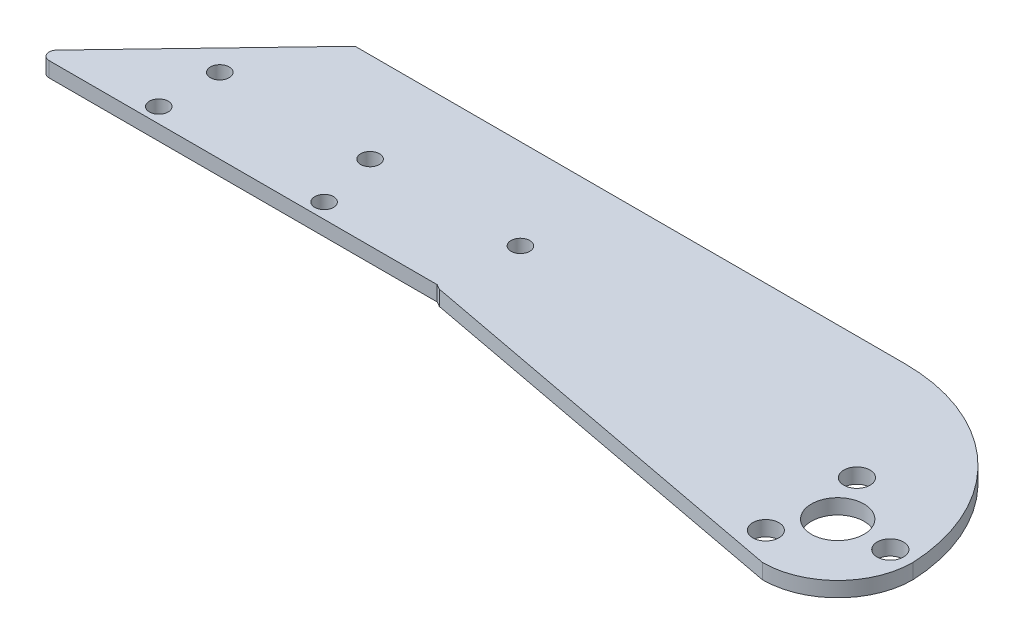
ISO-10303-21;
HEADER;
FILE_DESCRIPTION(('STEP AP214'),'2;1');
FILE_NAME('part.step','',(''),(''),'','','');
FILE_SCHEMA(('AUTOMOTIVE_DESIGN { 1 0 10303 214 1 1 1 1 }'));
ENDSEC;
DATA;
#1=APPLICATION_CONTEXT('core data for automotive mechanical design processes');
#2=APPLICATION_PROTOCOL_DEFINITION('international standard','automotive_design',2000,#1);
#3=PRODUCT_CONTEXT('',#1,'mechanical');
#4=PRODUCT('Part','Part','',(#3));
#5=PRODUCT_RELATED_PRODUCT_CATEGORY('part','',(#4));
#6=PRODUCT_DEFINITION_FORMATION('','',#4);
#7=PRODUCT_DEFINITION_CONTEXT('part definition',#1,'design');
#8=PRODUCT_DEFINITION('design','',#6,#7);
#9=PRODUCT_DEFINITION_SHAPE('','',#8);
#10=(LENGTH_UNIT() NAMED_UNIT(*) SI_UNIT(.MILLI.,.METRE.));
#11=(NAMED_UNIT(*) PLANE_ANGLE_UNIT() SI_UNIT($,.RADIAN.));
#12=(NAMED_UNIT(*) SI_UNIT($,.STERADIAN.) SOLID_ANGLE_UNIT());
#13=UNCERTAINTY_MEASURE_WITH_UNIT(LENGTH_MEASURE(1.E-05),#10,'distance_accuracy_value','');
#14=(GEOMETRIC_REPRESENTATION_CONTEXT(3) GLOBAL_UNCERTAINTY_ASSIGNED_CONTEXT((#13)) GLOBAL_UNIT_ASSIGNED_CONTEXT((#10,
#11,#12)) REPRESENTATION_CONTEXT('',''));
#15=CARTESIAN_POINT('',(0.,0.,0.));
#16=DIRECTION('',(0.,0.,1.));
#17=DIRECTION('',(1.,0.,0.));
#18=AXIS2_PLACEMENT_3D('',#15,#16,#17);
#19=CARTESIAN_POINT('',(-13.4171501514557,2.,1.0571224021706));
#20=DIRECTION('',(0.,-1.,0.));
#21=DIRECTION('',(0.,0.,-1.));
#22=AXIS2_PLACEMENT_3D('',#19,#20,#21);
#23=CYLINDRICAL_SURFACE('',#22,23.4409988905974);
#24=CARTESIAN_POINT('',(-13.4171501514557,0.,1.0571224021706));
#25=DIRECTION('',(0.,1.,0.));
#26=DIRECTION('',(0.,0.,1.));
#27=AXIS2_PLACEMENT_3D('',#24,#25,#26);
#28=CIRCLE('',#27,23.4409988905974);
#29=CARTESIAN_POINT('',(-13.4171501514557,0.,-22.3838764884268));
#30=VERTEX_POINT('',#29);
#31=CARTESIAN_POINT('',(10.,0.,0.));
#32=VERTEX_POINT('',#31);
#33=EDGE_CURVE('E104',#30,#32,#28,.F.);
#34=ORIENTED_EDGE('',*,*,#33,.F.);
#35=DIRECTION('',(0.,-1.,0.));
#36=VECTOR('',#35,1.);
#37=CARTESIAN_POINT('',(-13.4171501514557,2.,-22.3838764884268));
#38=LINE('',#37,#36);
#39=CARTESIAN_POINT('',(-13.4171501514557,2.,-22.3838764884268));
#40=VERTEX_POINT('',#39);
#41=EDGE_CURVE('E100',#40,#30,#38,.T.);
#42=ORIENTED_EDGE('',*,*,#41,.F.);
#43=CARTESIAN_POINT('',(-13.4171501514557,2.,1.0571224021706));
#44=DIRECTION('',(0.,1.,0.));
#45=DIRECTION('',(0.,0.,1.));
#46=AXIS2_PLACEMENT_3D('',#43,#44,#45);
#47=CIRCLE('',#46,23.4409988905974);
#48=CARTESIAN_POINT('',(10.,2.,0.));
#49=VERTEX_POINT('',#48);
#50=EDGE_CURVE('E102',#40,#49,#47,.F.);
#51=ORIENTED_EDGE('',*,*,#50,.T.);
#52=DIRECTION('',(0.,-1.,0.));
#53=VECTOR('',#52,1.);
#54=CARTESIAN_POINT('',(10.,2.,0.));
#55=LINE('',#54,#53);
#56=EDGE_CURVE('E156',#49,#32,#55,.T.);
#57=ORIENTED_EDGE('',*,*,#56,.T.);
#58=EDGE_LOOP('',(#34,#42,#51,#57));
#59=FACE_BOUND('',#58,.T.);
#60=ADVANCED_FACE('F37',(#59),#23,.T.);
#61=CARTESIAN_POINT('',(0.,2.,-22.3838764884268));
#62=DIRECTION('',(0.,0.,-1.));
#63=DIRECTION('',(-1.,0.,0.));
#64=AXIS2_PLACEMENT_3D('',#61,#62,#63);
#65=PLANE('',#64);
#66=DIRECTION('',(1.,0.,0.));
#67=VECTOR('',#66,1.);
#68=CARTESIAN_POINT('',(0.,0.,-22.3838764884268));
#69=LINE('',#68,#67);
#70=CARTESIAN_POINT('',(-86.5935335759817,0.,-22.3838764884269));
#71=VERTEX_POINT('',#70);
#72=EDGE_CURVE('E162',#71,#30,#69,.T.);
#73=ORIENTED_EDGE('',*,*,#72,.F.);
#74=DIRECTION('',(0.,-1.,0.));
#75=VECTOR('',#74,1.);
#76=CARTESIAN_POINT('',(-86.5935335759817,2.,-22.3838764884269));
#77=LINE('',#76,#75);
#78=CARTESIAN_POINT('',(-86.5935335759817,2.,-22.3838764884269));
#79=VERTEX_POINT('',#78);
#80=EDGE_CURVE('E110',#79,#71,#77,.T.);
#81=ORIENTED_EDGE('',*,*,#80,.F.);
#82=DIRECTION('',(1.,0.,0.));
#83=VECTOR('',#82,1.);
#84=CARTESIAN_POINT('',(0.,2.,-22.3838764884268));
#85=LINE('',#84,#83);
#86=EDGE_CURVE('E116',#79,#40,#85,.T.);
#87=ORIENTED_EDGE('',*,*,#86,.T.);
#88=ORIENTED_EDGE('',*,*,#41,.T.);
#89=EDGE_LOOP('',(#73,#81,#87,#88));
#90=FACE_BOUND('',#89,.T.);
#91=ADVANCED_FACE('F124',(#90),#65,.T.);
#92=CARTESIAN_POINT('',(-56.4093833666095,2.,-53.9462220344734));
#93=DIRECTION('',(-0.722709558015102,0.,-0.691151860847973));
#94=DIRECTION('',(-0.691151860847973,0.,0.722709558015102));
#95=AXIS2_PLACEMENT_3D('',#92,#93,#94);
#96=PLANE('',#95);
#97=DIRECTION('',(0.691151860847973,0.,-0.722709558015102));
#98=VECTOR('',#97,1.);
#99=CARTESIAN_POINT('',(-56.4093833666095,0.,-53.9462220344734));
#100=LINE('',#99,#98);
#101=CARTESIAN_POINT('',(-106.024068330656,0.,-2.06615186084796));
#102=VERTEX_POINT('',#101);
#103=EDGE_CURVE('E164',#102,#71,#100,.T.);
#104=ORIENTED_EDGE('',*,*,#103,.F.);
#105=DIRECTION('',(0.,-1.,0.));
#106=VECTOR('',#105,1.);
#107=CARTESIAN_POINT('',(-106.024068330656,2.,-2.06615186084796));
#108=LINE('',#107,#106);
#109=CARTESIAN_POINT('',(-106.024068330656,2.,-2.06615186084796));
#110=VERTEX_POINT('',#109);
#111=EDGE_CURVE('E45',#102,#110,#108,.F.);
#112=ORIENTED_EDGE('',*,*,#111,.T.);
#113=DIRECTION('',(0.691151860847973,0.,-0.722709558015102));
#114=VECTOR('',#113,1.);
#115=CARTESIAN_POINT('',(-56.4093833666095,2.,-53.9462220344734));
#116=LINE('',#115,#114);
#117=EDGE_CURVE('E126',#110,#79,#116,.T.);
#118=ORIENTED_EDGE('',*,*,#117,.T.);
#119=ORIENTED_EDGE('',*,*,#80,.T.);
#120=EDGE_LOOP('',(#104,#112,#118,#119));
#121=FACE_BOUND('',#120,.T.);
#122=ADVANCED_FACE('F234',(#121),#96,.T.);
#123=CARTESIAN_POINT('',(0.,2.,-0.375000000000007));
#124=DIRECTION('',(0.,0.,1.));
#125=DIRECTION('',(1.,0.,0.));
#126=AXIS2_PLACEMENT_3D('',#123,#124,#125);
#127=PLANE('',#126);
#128=DIRECTION('',(-1.,0.,0.));
#129=VECTOR('',#128,1.);
#130=CARTESIAN_POINT('',(0.,2.,-0.375000000000007));
#131=LINE('',#130,#129);
#132=CARTESIAN_POINT('',(-53.6614815653419,2.,-0.374999999999997));
#133=VERTEX_POINT('',#132);
#134=CARTESIAN_POINT('',(-105.301358772641,2.,-0.374999999999994));
#135=VERTEX_POINT('',#134);
#136=EDGE_CURVE('E128',#133,#135,#131,.T.);
#137=ORIENTED_EDGE('',*,*,#136,.T.);
#138=DIRECTION('',(0.,-1.,0.));
#139=VECTOR('',#138,1.);
#140=CARTESIAN_POINT('',(-105.301358772641,2.,-0.374999999999994));
#141=LINE('',#140,#139);
#142=CARTESIAN_POINT('',(-105.301358772641,0.,-0.374999999999994));
#143=VERTEX_POINT('',#142);
#144=EDGE_CURVE('E109',#135,#143,#141,.T.);
#145=ORIENTED_EDGE('',*,*,#144,.T.);
#146=DIRECTION('',(-1.,0.,0.));
#147=VECTOR('',#146,1.);
#148=CARTESIAN_POINT('',(0.,0.,-0.375000000000007));
#149=LINE('',#148,#147);
#150=CARTESIAN_POINT('',(-53.6614815653419,0.,-0.374999999999997));
#151=VERTEX_POINT('',#150);
#152=EDGE_CURVE('E166',#151,#143,#149,.T.);
#153=ORIENTED_EDGE('',*,*,#152,.F.);
#154=DIRECTION('',(0.,-1.,0.));
#155=VECTOR('',#154,1.);
#156=CARTESIAN_POINT('',(-53.6614815653419,2.,-0.374999999999997));
#157=LINE('',#156,#155);
#158=EDGE_CURVE('E197',#133,#151,#157,.T.);
#159=ORIENTED_EDGE('',*,*,#158,.F.);
#160=EDGE_LOOP('',(#137,#145,#153,#159));
#161=FACE_BOUND('',#160,.T.);
#162=ADVANCED_FACE('F205',(#161),#127,.T.);
#163=CARTESIAN_POINT('',(-12.890601743898,2.,22.7383877860065));
#164=DIRECTION('',(-0.493172283110339,0.,0.869931663506816));
#165=DIRECTION('',(0.869931663506816,0.,0.493172283110339));
#166=AXIS2_PLACEMENT_3D('',#163,#164,#165);
#167=PLANE('',#166);
#168=DIRECTION('',(-0.869931663506816,0.,-0.493172283110339));
#169=VECTOR('',#168,1.);
#170=CARTESIAN_POINT('',(-12.890601743898,0.,22.7383877860065));
#171=LINE('',#170,#169);
#172=CARTESIAN_POINT('',(-53.,0.,0.));
#173=VERTEX_POINT('',#172);
#174=EDGE_CURVE('E168',#173,#151,#171,.T.);
#175=ORIENTED_EDGE('',*,*,#174,.F.);
#176=DIRECTION('',(0.,-1.,0.));
#177=VECTOR('',#176,1.);
#178=CARTESIAN_POINT('',(-53.,2.,0.));
#179=LINE('',#178,#177);
#180=CARTESIAN_POINT('',(-53.,2.,0.));
#181=VERTEX_POINT('',#180);
#182=EDGE_CURVE('E195',#181,#173,#179,.T.);
#183=ORIENTED_EDGE('',*,*,#182,.F.);
#184=DIRECTION('',(-0.869931663506816,0.,-0.493172283110339));
#185=VECTOR('',#184,1.);
#186=CARTESIAN_POINT('',(-12.890601743898,2.,22.7383877860065));
#187=LINE('',#186,#185);
#188=EDGE_CURVE('E134',#181,#133,#187,.T.);
#189=ORIENTED_EDGE('',*,*,#188,.T.);
#190=ORIENTED_EDGE('',*,*,#158,.T.);
#191=EDGE_LOOP('',(#175,#183,#189,#190));
#192=FACE_BOUND('',#191,.T.);
#193=ADVANCED_FACE('F215',(#192),#167,.T.);
#194=CARTESIAN_POINT('',(-1.82193193537298,2.,9.6562392574768));
#195=DIRECTION('',(-0.185407859197825,0.,0.982661653748471));
#196=DIRECTION('',(0.982661653748471,0.,0.185407859197825));
#197=AXIS2_PLACEMENT_3D('',#194,#195,#196);
#198=PLANE('',#197);
#199=DIRECTION('',(-0.982661653748471,0.,-0.185407859197825));
#200=VECTOR('',#199,1.);
#201=CARTESIAN_POINT('',(-1.82193193537298,0.,9.6562392574768));
#202=LINE('',#201,#200);
#203=CARTESIAN_POINT('',(0.,0.,10.));
#204=VERTEX_POINT('',#203);
#205=EDGE_CURVE('E171',#204,#173,#202,.T.);
#206=ORIENTED_EDGE('',*,*,#205,.F.);
#207=DIRECTION('',(0.,-1.,0.));
#208=VECTOR('',#207,1.);
#209=CARTESIAN_POINT('',(0.,2.,10.));
#210=LINE('',#209,#208);
#211=CARTESIAN_POINT('',(0.,2.,10.));
#212=VERTEX_POINT('',#211);
#213=EDGE_CURVE('E193',#212,#204,#210,.T.);
#214=ORIENTED_EDGE('',*,*,#213,.F.);
#215=DIRECTION('',(-0.982661653748471,0.,-0.185407859197825));
#216=VECTOR('',#215,1.);
#217=CARTESIAN_POINT('',(-1.82193193537298,2.,9.6562392574768));
#218=LINE('',#217,#216);
#219=EDGE_CURVE('E137',#212,#181,#218,.T.);
#220=ORIENTED_EDGE('',*,*,#219,.T.);
#221=ORIENTED_EDGE('',*,*,#182,.T.);
#222=EDGE_LOOP('',(#206,#214,#220,#221));
#223=FACE_BOUND('',#222,.T.);
#224=ADVANCED_FACE('F294',(#223),#198,.T.);
#225=CARTESIAN_POINT('',(-92.7051831779957,2.,-2.375));
#226=DIRECTION('',(0.,-1.,0.));
#227=DIRECTION('',(0.,0.,-1.));
#228=AXIS2_PLACEMENT_3D('',#225,#226,#227);
#229=CYLINDRICAL_SURFACE('',#228,1.25);
#230=CARTESIAN_POINT('',(-92.7051831779957,2.,-2.375));
#231=DIRECTION('',(0.,1.,0.));
#232=DIRECTION('',(0.,0.,1.));
#233=AXIS2_PLACEMENT_3D('',#230,#231,#232);
#234=CIRCLE('',#233,1.25);
#235=CARTESIAN_POINT('',(-92.7051831779957,2.,-1.125));
#236=VERTEX_POINT('',#235);
#237=EDGE_CURVE('E150',#236,#236,#234,.T.);
#238=ORIENTED_EDGE('',*,*,#237,.T.);
#239=EDGE_LOOP('',(#238));
#240=FACE_BOUND('',#239,.T.);
#241=CARTESIAN_POINT('',(-92.7051831779957,0.,-2.375));
#242=DIRECTION('',(0.,1.,0.));
#243=DIRECTION('',(0.,0.,1.));
#244=AXIS2_PLACEMENT_3D('',#241,#242,#243);
#245=CIRCLE('',#244,1.25);
#246=CARTESIAN_POINT('',(-92.7051831779957,0.,-1.125));
#247=VERTEX_POINT('',#246);
#248=EDGE_CURVE('E186',#247,#247,#245,.T.);
#249=ORIENTED_EDGE('',*,*,#248,.F.);
#250=EDGE_LOOP('',(#249));
#251=FACE_BOUND('',#250,.T.);
#252=ADVANCED_FACE('F290',(#240,#251),#229,.F.);
#253=CARTESIAN_POINT('',(-70.7051831779957,2.,-2.375));
#254=DIRECTION('',(0.,-1.,0.));
#255=DIRECTION('',(0.,0.,-1.));
#256=AXIS2_PLACEMENT_3D('',#253,#254,#255);
#257=CYLINDRICAL_SURFACE('',#256,1.25);
#258=CARTESIAN_POINT('',(-70.7051831779957,2.,-2.375));
#259=DIRECTION('',(0.,1.,0.));
#260=DIRECTION('',(0.,0.,1.));
#261=AXIS2_PLACEMENT_3D('',#258,#259,#260);
#262=CIRCLE('',#261,1.25);
#263=CARTESIAN_POINT('',(-70.7051831779957,2.,-1.125));
#264=VERTEX_POINT('',#263);
#265=EDGE_CURVE('E147',#264,#264,#262,.T.);
#266=ORIENTED_EDGE('',*,*,#265,.T.);
#267=EDGE_LOOP('',(#266));
#268=FACE_BOUND('',#267,.T.);
#269=CARTESIAN_POINT('',(-70.7051831779957,0.,-2.375));
#270=DIRECTION('',(0.,1.,0.));
#271=DIRECTION('',(0.,0.,1.));
#272=AXIS2_PLACEMENT_3D('',#269,#270,#271);
#273=CIRCLE('',#272,1.25);
#274=CARTESIAN_POINT('',(-70.7051831779957,0.,-1.125));
#275=VERTEX_POINT('',#274);
#276=EDGE_CURVE('E183',#275,#275,#273,.T.);
#277=ORIENTED_EDGE('',*,*,#276,.F.);
#278=EDGE_LOOP('',(#277));
#279=FACE_BOUND('',#278,.T.);
#280=ADVANCED_FACE('F293',(#268,#279),#257,.F.);
#281=CARTESIAN_POINT('',(-3.5,2.,6.06217782649107));
#282=DIRECTION('',(0.,-1.,0.));
#283=DIRECTION('',(0.,0.,-1.));
#284=AXIS2_PLACEMENT_3D('',#281,#282,#283);
#285=CYLINDRICAL_SURFACE('',#284,1.75);
#286=CARTESIAN_POINT('',(-3.5,2.,6.06217782649107));
#287=DIRECTION('',(0.,1.,0.));
#288=DIRECTION('',(0.,0.,1.));
#289=AXIS2_PLACEMENT_3D('',#286,#287,#288);
#290=CIRCLE('',#289,1.75);
#291=CARTESIAN_POINT('',(-3.5,2.,7.81217782649107));
#292=VERTEX_POINT('',#291);
#293=EDGE_CURVE('E144',#292,#292,#290,.T.);
#294=ORIENTED_EDGE('',*,*,#293,.T.);
#295=EDGE_LOOP('',(#294));
#296=FACE_BOUND('',#295,.T.);
#297=CARTESIAN_POINT('',(-3.5,0.,6.06217782649107));
#298=DIRECTION('',(0.,1.,0.));
#299=DIRECTION('',(0.,0.,1.));
#300=AXIS2_PLACEMENT_3D('',#297,#298,#299);
#301=CIRCLE('',#300,1.75);
#302=CARTESIAN_POINT('',(-3.5,0.,7.81217782649107));
#303=VERTEX_POINT('',#302);
#304=EDGE_CURVE('E180',#303,#303,#301,.T.);
#305=ORIENTED_EDGE('',*,*,#304,.F.);
#306=EDGE_LOOP('',(#305));
#307=FACE_BOUND('',#306,.T.);
#308=ADVANCED_FACE('F298',(#296,#307),#285,.F.);
#309=CARTESIAN_POINT('',(-3.5,2.,-6.06217782649107));
#310=DIRECTION('',(0.,-1.,0.));
#311=DIRECTION('',(0.,0.,-1.));
#312=AXIS2_PLACEMENT_3D('',#309,#310,#311);
#313=CYLINDRICAL_SURFACE('',#312,1.75);
#314=CARTESIAN_POINT('',(-3.5,2.,-6.06217782649107));
#315=DIRECTION('',(0.,1.,0.));
#316=DIRECTION('',(0.,0.,1.));
#317=AXIS2_PLACEMENT_3D('',#314,#315,#316);
#318=CIRCLE('',#317,1.75);
#319=CARTESIAN_POINT('',(-3.5,2.,-4.31217782649107));
#320=VERTEX_POINT('',#319);
#321=EDGE_CURVE('E141',#320,#320,#318,.T.);
#322=ORIENTED_EDGE('',*,*,#321,.T.);
#323=EDGE_LOOP('',(#322));
#324=FACE_BOUND('',#323,.T.);
#325=CARTESIAN_POINT('',(-3.5,0.,-6.06217782649107));
#326=DIRECTION('',(0.,1.,0.));
#327=DIRECTION('',(0.,0.,1.));
#328=AXIS2_PLACEMENT_3D('',#325,#326,#327);
#329=CIRCLE('',#328,1.75);
#330=CARTESIAN_POINT('',(-3.5,0.,-4.31217782649107));
#331=VERTEX_POINT('',#330);
#332=EDGE_CURVE('E177',#331,#331,#329,.T.);
#333=ORIENTED_EDGE('',*,*,#332,.F.);
#334=EDGE_LOOP('',(#333));
#335=FACE_BOUND('',#334,.T.);
#336=ADVANCED_FACE('F248',(#324,#335),#313,.F.);
#337=CARTESIAN_POINT('',(0.,2.,0.));
#338=DIRECTION('',(0.,-1.,0.));
#339=DIRECTION('',(0.,0.,-1.));
#340=AXIS2_PLACEMENT_3D('',#337,#338,#339);
#341=CYLINDRICAL_SURFACE('',#340,10.);
#342=CARTESIAN_POINT('',(0.,0.,0.));
#343=DIRECTION('',(0.,1.,0.));
#344=DIRECTION('',(0.,0.,1.));
#345=AXIS2_PLACEMENT_3D('',#342,#343,#344);
#346=CIRCLE('',#345,10.);
#347=EDGE_CURVE('E174',#204,#32,#346,.T.);
#348=ORIENTED_EDGE('',*,*,#347,.T.);
#349=ORIENTED_EDGE('',*,*,#56,.F.);
#350=CARTESIAN_POINT('',(0.,2.,0.));
#351=DIRECTION('',(0.,1.,0.));
#352=DIRECTION('',(0.,0.,1.));
#353=AXIS2_PLACEMENT_3D('',#350,#351,#352);
#354=CIRCLE('',#353,10.);
#355=EDGE_CURVE('E119',#212,#49,#354,.T.);
#356=ORIENTED_EDGE('',*,*,#355,.F.);
#357=ORIENTED_EDGE('',*,*,#213,.T.);
#358=EDGE_LOOP('',(#348,#349,#356,#357));
#359=FACE_BOUND('',#358,.T.);
#360=ADVANCED_FACE('F240',(#359),#341,.T.);
#361=CARTESIAN_POINT('',(0.,2.,0.));
#362=DIRECTION('',(0.,-1.,0.));
#363=DIRECTION('',(0.,0.,-1.));
#364=AXIS2_PLACEMENT_3D('',#361,#362,#363);
#365=CYLINDRICAL_SURFACE('',#364,3.5);
#366=CARTESIAN_POINT('',(0.,2.,0.));
#367=DIRECTION('',(0.,1.,0.));
#368=DIRECTION('',(0.,0.,1.));
#369=AXIS2_PLACEMENT_3D('',#366,#367,#368);
#370=CIRCLE('',#369,3.5);
#371=CARTESIAN_POINT('',(0.,2.,3.5));
#372=VERTEX_POINT('',#371);
#373=EDGE_CURVE('E121',#372,#372,#370,.T.);
#374=ORIENTED_EDGE('',*,*,#373,.T.);
#375=EDGE_LOOP('',(#374));
#376=FACE_BOUND('',#375,.T.);
#377=CARTESIAN_POINT('',(0.,0.,0.));
#378=DIRECTION('',(0.,1.,0.));
#379=DIRECTION('',(0.,0.,1.));
#380=AXIS2_PLACEMENT_3D('',#377,#378,#379);
#381=CIRCLE('',#380,3.5);
#382=CARTESIAN_POINT('',(0.,0.,3.5));
#383=VERTEX_POINT('',#382);
#384=EDGE_CURVE('E157',#383,#383,#381,.T.);
#385=ORIENTED_EDGE('',*,*,#384,.F.);
#386=EDGE_LOOP('',(#385));
#387=FACE_BOUND('',#386,.T.);
#388=ADVANCED_FACE('F237',(#376,#387),#365,.F.);
#389=CARTESIAN_POINT('',(7.,2.,0.));
#390=DIRECTION('',(0.,-1.,0.));
#391=DIRECTION('',(0.,0.,-1.));
#392=AXIS2_PLACEMENT_3D('',#389,#390,#391);
#393=CYLINDRICAL_SURFACE('',#392,1.75);
#394=CARTESIAN_POINT('',(7.,2.,0.));
#395=DIRECTION('',(0.,1.,0.));
#396=DIRECTION('',(0.,0.,1.));
#397=AXIS2_PLACEMENT_3D('',#394,#395,#396);
#398=CIRCLE('',#397,1.75);
#399=CARTESIAN_POINT('',(7.,2.,1.75));
#400=VERTEX_POINT('',#399);
#401=EDGE_CURVE('E153',#400,#400,#398,.T.);
#402=ORIENTED_EDGE('',*,*,#401,.T.);
#403=EDGE_LOOP('',(#402));
#404=FACE_BOUND('',#403,.T.);
#405=CARTESIAN_POINT('',(7.,0.,0.));
#406=DIRECTION('',(0.,1.,0.));
#407=DIRECTION('',(0.,0.,1.));
#408=AXIS2_PLACEMENT_3D('',#405,#406,#407);
#409=CIRCLE('',#408,1.75);
#410=CARTESIAN_POINT('',(7.,0.,1.75));
#411=VERTEX_POINT('',#410);
#412=EDGE_CURVE('E189',#411,#411,#409,.T.);
#413=ORIENTED_EDGE('',*,*,#412,.F.);
#414=EDGE_LOOP('',(#413));
#415=FACE_BOUND('',#414,.T.);
#416=ADVANCED_FACE('F239',(#404,#415),#393,.F.);
#417=CARTESIAN_POINT('',(0.,2.,0.));
#418=DIRECTION('',(0.,1.,0.));
#419=DIRECTION('',(0.,0.,1.));
#420=AXIS2_PLACEMENT_3D('',#417,#418,#419);
#421=PLANE('',#420);
#422=CARTESIAN_POINT('',(-72.5935335759817,2.,-10.375));
#423=DIRECTION('',(0.,1.,0.));
#424=DIRECTION('',(0.,0.,1.));
#425=AXIS2_PLACEMENT_3D('',#422,#423,#424);
#426=CIRCLE('',#425,1.25);
#427=CARTESIAN_POINT('',(-72.5935335759817,2.,-9.125));
#428=VERTEX_POINT('',#427);
#429=EDGE_CURVE('E263',#428,#428,#426,.T.);
#430=ORIENTED_EDGE('',*,*,#429,.F.);
#431=EDGE_LOOP('',(#430));
#432=FACE_BOUND('',#431,.T.);
#433=CARTESIAN_POINT('',(-52.5935335759817,2.,-10.375));
#434=DIRECTION('',(0.,1.,0.));
#435=DIRECTION('',(0.,0.,1.));
#436=AXIS2_PLACEMENT_3D('',#433,#434,#435);
#437=CIRCLE('',#436,1.25000000000001);
#438=CARTESIAN_POINT('',(-52.5935335759817,2.,-9.125));
#439=VERTEX_POINT('',#438);
#440=EDGE_CURVE('E266',#439,#439,#437,.T.);
#441=ORIENTED_EDGE('',*,*,#440,.F.);
#442=EDGE_LOOP('',(#441));
#443=FACE_BOUND('',#442,.T.);
#444=CARTESIAN_POINT('',(-92.5935335759817,2.,-10.375));
#445=DIRECTION('',(0.,1.,0.));
#446=DIRECTION('',(0.,0.,1.));
#447=AXIS2_PLACEMENT_3D('',#444,#445,#446);
#448=CIRCLE('',#447,1.25);
#449=CARTESIAN_POINT('',(-92.5935335759817,2.,-9.125));
#450=VERTEX_POINT('',#449);
#451=EDGE_CURVE('E160',#450,#450,#448,.T.);
#452=ORIENTED_EDGE('',*,*,#451,.F.);
#453=EDGE_LOOP('',(#452));
#454=FACE_BOUND('',#453,.T.);
#455=ORIENTED_EDGE('',*,*,#373,.F.);
#456=EDGE_LOOP('',(#455));
#457=FACE_BOUND('',#456,.T.);
#458=ORIENTED_EDGE('',*,*,#117,.F.);
#459=CARTESIAN_POINT('',(-105.301358772641,2.,-1.37499999999999));
#460=DIRECTION('',(0.,1.,0.));
#461=DIRECTION('',(0.,0.,1.));
#462=AXIS2_PLACEMENT_3D('',#459,#460,#461);
#463=CIRCLE('',#462,1.);
#464=EDGE_CURVE('E11',#110,#135,#463,.T.);
#465=ORIENTED_EDGE('',*,*,#464,.T.);
#466=ORIENTED_EDGE('',*,*,#136,.F.);
#467=ORIENTED_EDGE('',*,*,#188,.F.);
#468=ORIENTED_EDGE('',*,*,#219,.F.);
#469=ORIENTED_EDGE('',*,*,#355,.T.);
#470=ORIENTED_EDGE('',*,*,#50,.F.);
#471=ORIENTED_EDGE('',*,*,#86,.F.);
#472=EDGE_LOOP('',(#458,#465,#466,#467,#468,#469,#470,#471));
#473=FACE_BOUND('',#472,.T.);
#474=ORIENTED_EDGE('',*,*,#321,.F.);
#475=EDGE_LOOP('',(#474));
#476=FACE_BOUND('',#475,.T.);
#477=ORIENTED_EDGE('',*,*,#293,.F.);
#478=EDGE_LOOP('',(#477));
#479=FACE_BOUND('',#478,.T.);
#480=ORIENTED_EDGE('',*,*,#265,.F.);
#481=EDGE_LOOP('',(#480));
#482=FACE_BOUND('',#481,.T.);
#483=ORIENTED_EDGE('',*,*,#237,.F.);
#484=EDGE_LOOP('',(#483));
#485=FACE_BOUND('',#484,.T.);
#486=ORIENTED_EDGE('',*,*,#401,.F.);
#487=EDGE_LOOP('',(#486));
#488=FACE_BOUND('',#487,.T.);
#489=ADVANCED_FACE('F114',(#432,#443,#454,#457,#473,#476,#479,#482,#485,#488),#421,.T.);
#490=CARTESIAN_POINT('',(0.,0.,0.));
#491=DIRECTION('',(0.,1.,0.));
#492=DIRECTION('',(0.,0.,1.));
#493=AXIS2_PLACEMENT_3D('',#490,#491,#492);
#494=PLANE('',#493);
#495=CARTESIAN_POINT('',(-72.5935335759817,0.,-10.375));
#496=DIRECTION('',(0.,1.,0.));
#497=DIRECTION('',(0.,0.,1.));
#498=AXIS2_PLACEMENT_3D('',#495,#496,#497);
#499=CIRCLE('',#498,1.25);
#500=CARTESIAN_POINT('',(-72.5935335759817,0.,-9.125));
#501=VERTEX_POINT('',#500);
#502=EDGE_CURVE('E269',#501,#501,#499,.T.);
#503=ORIENTED_EDGE('',*,*,#502,.T.);
#504=EDGE_LOOP('',(#503));
#505=FACE_BOUND('',#504,.T.);
#506=CARTESIAN_POINT('',(-52.5935335759817,0.,-10.375));
#507=DIRECTION('',(0.,1.,0.));
#508=DIRECTION('',(0.,0.,1.));
#509=AXIS2_PLACEMENT_3D('',#506,#507,#508);
#510=CIRCLE('',#509,1.25000000000001);
#511=CARTESIAN_POINT('',(-52.5935335759817,0.,-9.125));
#512=VERTEX_POINT('',#511);
#513=EDGE_CURVE('E270',#512,#512,#510,.T.);
#514=ORIENTED_EDGE('',*,*,#513,.T.);
#515=EDGE_LOOP('',(#514));
#516=FACE_BOUND('',#515,.T.);
#517=CARTESIAN_POINT('',(-92.5935335759817,0.,-10.375));
#518=DIRECTION('',(0.,1.,0.));
#519=DIRECTION('',(0.,0.,1.));
#520=AXIS2_PLACEMENT_3D('',#517,#518,#519);
#521=CIRCLE('',#520,1.25);
#522=CARTESIAN_POINT('',(-92.5935335759817,0.,-9.125));
#523=VERTEX_POINT('',#522);
#524=EDGE_CURVE('E260',#523,#523,#521,.T.);
#525=ORIENTED_EDGE('',*,*,#524,.T.);
#526=EDGE_LOOP('',(#525));
#527=FACE_BOUND('',#526,.T.);
#528=ORIENTED_EDGE('',*,*,#384,.T.);
#529=EDGE_LOOP('',(#528));
#530=FACE_BOUND('',#529,.T.);
#531=ORIENTED_EDGE('',*,*,#152,.T.);
#532=CARTESIAN_POINT('',(-105.301358772641,0.,-1.37499999999999));
#533=DIRECTION('',(0.,1.,0.));
#534=DIRECTION('',(0.,0.,1.));
#535=AXIS2_PLACEMENT_3D('',#532,#533,#534);
#536=CIRCLE('',#535,1.);
#537=EDGE_CURVE('E59',#143,#102,#536,.F.);
#538=ORIENTED_EDGE('',*,*,#537,.T.);
#539=ORIENTED_EDGE('',*,*,#103,.T.);
#540=ORIENTED_EDGE('',*,*,#72,.T.);
#541=ORIENTED_EDGE('',*,*,#33,.T.);
#542=ORIENTED_EDGE('',*,*,#347,.F.);
#543=ORIENTED_EDGE('',*,*,#205,.T.);
#544=ORIENTED_EDGE('',*,*,#174,.T.);
#545=EDGE_LOOP('',(#531,#538,#539,#540,#541,#542,#543,#544));
#546=FACE_BOUND('',#545,.T.);
#547=ORIENTED_EDGE('',*,*,#332,.T.);
#548=EDGE_LOOP('',(#547));
#549=FACE_BOUND('',#548,.T.);
#550=ORIENTED_EDGE('',*,*,#304,.T.);
#551=EDGE_LOOP('',(#550));
#552=FACE_BOUND('',#551,.T.);
#553=ORIENTED_EDGE('',*,*,#276,.T.);
#554=EDGE_LOOP('',(#553));
#555=FACE_BOUND('',#554,.T.);
#556=ORIENTED_EDGE('',*,*,#248,.T.);
#557=EDGE_LOOP('',(#556));
#558=FACE_BOUND('',#557,.T.);
#559=ORIENTED_EDGE('',*,*,#412,.T.);
#560=EDGE_LOOP('',(#559));
#561=FACE_BOUND('',#560,.T.);
#562=ADVANCED_FACE('F209',(#505,#516,#527,#530,#546,#549,#552,#555,#558,#561),#494,.F.);
#563=CARTESIAN_POINT('',(-105.301358772641,2.,-1.37499999999999));
#564=DIRECTION('',(0.,-1.,0.));
#565=DIRECTION('',(0.,0.,-1.));
#566=AXIS2_PLACEMENT_3D('',#563,#564,#565);
#567=CYLINDRICAL_SURFACE('',#566,1.);
#568=ORIENTED_EDGE('',*,*,#464,.F.);
#569=ORIENTED_EDGE('',*,*,#111,.F.);
#570=ORIENTED_EDGE('',*,*,#537,.F.);
#571=ORIENTED_EDGE('',*,*,#144,.F.);
#572=EDGE_LOOP('',(#568,#569,#570,#571));
#573=FACE_BOUND('',#572,.T.);
#574=ADVANCED_FACE('F39',(#573),#567,.T.);
#575=CARTESIAN_POINT('',(-92.5935335759817,0.,-10.375));
#576=DIRECTION('',(0.,1.,0.));
#577=DIRECTION('',(0.,0.,1.));
#578=AXIS2_PLACEMENT_3D('',#575,#576,#577);
#579=CYLINDRICAL_SURFACE('',#578,1.25);
#580=ORIENTED_EDGE('',*,*,#451,.T.);
#581=EDGE_LOOP('',(#580));
#582=FACE_BOUND('',#581,.T.);
#583=ORIENTED_EDGE('',*,*,#524,.F.);
#584=EDGE_LOOP('',(#583));
#585=FACE_BOUND('',#584,.T.);
#586=ADVANCED_FACE('F218',(#582,#585),#579,.F.);
#587=CARTESIAN_POINT('',(-52.5935335759817,0.,-10.375));
#588=DIRECTION('',(0.,1.,0.));
#589=DIRECTION('',(0.,0.,1.));
#590=AXIS2_PLACEMENT_3D('',#587,#588,#589);
#591=CYLINDRICAL_SURFACE('',#590,1.25000000000001);
#592=ORIENTED_EDGE('',*,*,#440,.T.);
#593=EDGE_LOOP('',(#592));
#594=FACE_BOUND('',#593,.T.);
#595=ORIENTED_EDGE('',*,*,#513,.F.);
#596=EDGE_LOOP('',(#595));
#597=FACE_BOUND('',#596,.T.);
#598=ADVANCED_FACE('F223',(#594,#597),#591,.F.);
#599=CARTESIAN_POINT('',(-72.5935335759817,0.,-10.375));
#600=DIRECTION('',(0.,1.,0.));
#601=DIRECTION('',(0.,0.,1.));
#602=AXIS2_PLACEMENT_3D('',#599,#600,#601);
#603=CYLINDRICAL_SURFACE('',#602,1.25);
#604=ORIENTED_EDGE('',*,*,#429,.T.);
#605=EDGE_LOOP('',(#604));
#606=FACE_BOUND('',#605,.T.);
#607=ORIENTED_EDGE('',*,*,#502,.F.);
#608=EDGE_LOOP('',(#607));
#609=FACE_BOUND('',#608,.T.);
#610=ADVANCED_FACE('F277',(#606,#609),#603,.F.);
#611=CLOSED_SHELL('',(#60,#91,#122,#162,#193,#224,#252,#280,#308,#336,#360,#388,#416,#489,#562,
#574,#586,#598,#610));
#612=MANIFOLD_SOLID_BREP('B2',#611);
#613=ADVANCED_BREP_SHAPE_REPRESENTATION('',(#18,#612),#14);
#614=SHAPE_DEFINITION_REPRESENTATION(#9,#613);
ENDSEC;
END-ISO-10303-21;
